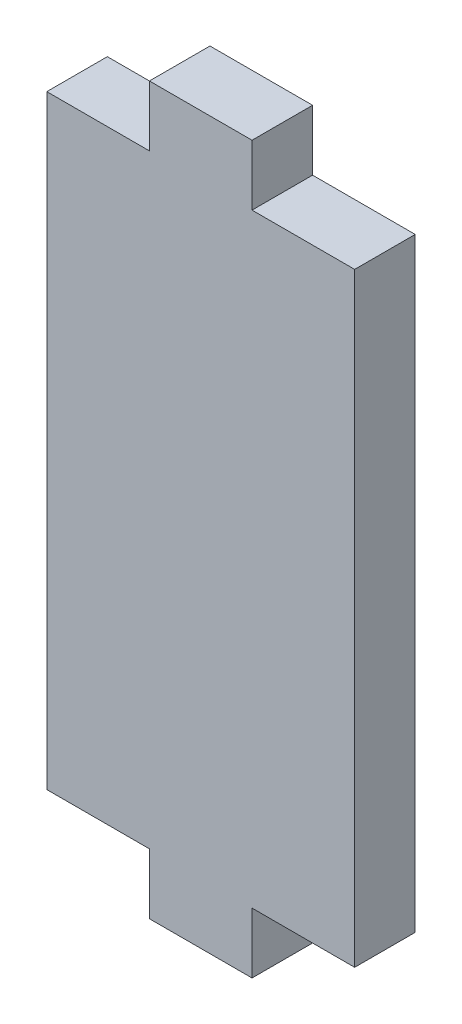
ISO-10303-21;
HEADER;
FILE_DESCRIPTION(('STEP AP214'),'2;1');
FILE_NAME('part.step','',(''),(''),'','','');
FILE_SCHEMA(('AUTOMOTIVE_DESIGN { 1 0 10303 214 1 1 1 1 }'));
ENDSEC;
DATA;
#1=APPLICATION_CONTEXT('core data for automotive mechanical design processes');
#2=APPLICATION_PROTOCOL_DEFINITION('international standard','automotive_design',2000,#1);
#3=PRODUCT_CONTEXT('',#1,'mechanical');
#4=PRODUCT('Part','Part','',(#3));
#5=PRODUCT_RELATED_PRODUCT_CATEGORY('part','',(#4));
#6=PRODUCT_DEFINITION_FORMATION('','',#4);
#7=PRODUCT_DEFINITION_CONTEXT('part definition',#1,'design');
#8=PRODUCT_DEFINITION('design','',#6,#7);
#9=PRODUCT_DEFINITION_SHAPE('','',#8);
#10=(LENGTH_UNIT() NAMED_UNIT(*) SI_UNIT(.MILLI.,.METRE.));
#11=(NAMED_UNIT(*) PLANE_ANGLE_UNIT() SI_UNIT($,.RADIAN.));
#12=(NAMED_UNIT(*) SI_UNIT($,.STERADIAN.) SOLID_ANGLE_UNIT());
#13=UNCERTAINTY_MEASURE_WITH_UNIT(LENGTH_MEASURE(1.E-05),#10,'distance_accuracy_value','');
#14=(GEOMETRIC_REPRESENTATION_CONTEXT(3) GLOBAL_UNCERTAINTY_ASSIGNED_CONTEXT((#13)) GLOBAL_UNIT_ASSIGNED_CONTEXT((#10,
#11,#12)) REPRESENTATION_CONTEXT('',''));
#15=CARTESIAN_POINT('',(0.,0.,0.));
#16=DIRECTION('',(0.,0.,1.));
#17=DIRECTION('',(1.,0.,0.));
#18=AXIS2_PLACEMENT_3D('',#15,#16,#17);
#19=CARTESIAN_POINT('',(0.,-29.45,5.9));
#20=DIRECTION('',(0.,1.,0.));
#21=DIRECTION('',(-1.,0.,0.));
#22=AXIS2_PLACEMENT_3D('',#19,#20,#21);
#23=PLANE('',#22);
#24=DIRECTION('',(1.,0.,0.));
#25=VECTOR('',#24,1.);
#26=CARTESIAN_POINT('',(0.,-29.45,0.));
#27=LINE('',#26,#25);
#28=CARTESIAN_POINT('',(-15.,-29.45,0.));
#29=VERTEX_POINT('',#28);
#30=CARTESIAN_POINT('',(-5.,-29.45,0.));
#31=VERTEX_POINT('',#30);
#32=EDGE_CURVE('E219',#29,#31,#27,.T.);
#33=ORIENTED_EDGE('',*,*,#32,.T.);
#34=DIRECTION('',(0.,0.,-1.));
#35=VECTOR('',#34,1.);
#36=CARTESIAN_POINT('',(-5.,-29.45,5.9));
#37=LINE('',#36,#35);
#38=CARTESIAN_POINT('',(-5.,-29.45,5.9));
#39=VERTEX_POINT('',#38);
#40=EDGE_CURVE('E11',#39,#31,#37,.T.);
#41=ORIENTED_EDGE('',*,*,#40,.F.);
#42=DIRECTION('',(1.,0.,0.));
#43=VECTOR('',#42,1.);
#44=CARTESIAN_POINT('',(0.,-29.45,5.9));
#45=LINE('',#44,#43);
#46=CARTESIAN_POINT('',(-15.,-29.45,5.9));
#47=VERTEX_POINT('',#46);
#48=EDGE_CURVE('E170',#47,#39,#45,.T.);
#49=ORIENTED_EDGE('',*,*,#48,.F.);
#50=DIRECTION('',(0.,0.,-1.));
#51=VECTOR('',#50,1.);
#52=CARTESIAN_POINT('',(-15.,-29.45,5.9));
#53=LINE('',#52,#51);
#54=EDGE_CURVE('E55',#47,#29,#53,.T.);
#55=ORIENTED_EDGE('',*,*,#54,.T.);
#56=EDGE_LOOP('',(#33,#41,#49,#55));
#57=FACE_BOUND('',#56,.T.);
#58=ADVANCED_FACE('F38',(#57),#23,.F.);
#59=CARTESIAN_POINT('',(-5.,0.,5.9));
#60=DIRECTION('',(1.,0.,0.));
#61=DIRECTION('',(0.,1.,0.));
#62=AXIS2_PLACEMENT_3D('',#59,#60,#61);
#63=PLANE('',#62);
#64=DIRECTION('',(0.,-1.,0.));
#65=VECTOR('',#64,1.);
#66=CARTESIAN_POINT('',(-5.,0.,0.));
#67=LINE('',#66,#65);
#68=CARTESIAN_POINT('',(-5.,-35.35,0.));
#69=VERTEX_POINT('',#68);
#70=EDGE_CURVE('E212',#31,#69,#67,.T.);
#71=ORIENTED_EDGE('',*,*,#70,.T.);
#72=DIRECTION('',(0.,0.,-1.));
#73=VECTOR('',#72,1.);
#74=CARTESIAN_POINT('',(-5.,-35.35,5.9));
#75=LINE('',#74,#73);
#76=CARTESIAN_POINT('',(-5.,-35.35,5.9));
#77=VERTEX_POINT('',#76);
#78=EDGE_CURVE('E47',#77,#69,#75,.T.);
#79=ORIENTED_EDGE('',*,*,#78,.F.);
#80=DIRECTION('',(0.,-1.,0.));
#81=VECTOR('',#80,1.);
#82=CARTESIAN_POINT('',(-5.,0.,5.9));
#83=LINE('',#82,#81);
#84=EDGE_CURVE('E105',#39,#77,#83,.T.);
#85=ORIENTED_EDGE('',*,*,#84,.F.);
#86=ORIENTED_EDGE('',*,*,#40,.T.);
#87=EDGE_LOOP('',(#71,#79,#85,#86));
#88=FACE_BOUND('',#87,.T.);
#89=ADVANCED_FACE('F40',(#88),#63,.F.);
#90=CARTESIAN_POINT('',(0.,-35.35,5.9));
#91=DIRECTION('',(0.,1.,0.));
#92=DIRECTION('',(0.,0.,1.));
#93=AXIS2_PLACEMENT_3D('',#90,#91,#92);
#94=PLANE('',#93);
#95=DIRECTION('',(1.,0.,0.));
#96=VECTOR('',#95,1.);
#97=CARTESIAN_POINT('',(0.,-35.35,0.));
#98=LINE('',#97,#96);
#99=CARTESIAN_POINT('',(5.,-35.35,0.));
#100=VERTEX_POINT('',#99);
#101=EDGE_CURVE('E209',#69,#100,#98,.T.);
#102=ORIENTED_EDGE('',*,*,#101,.T.);
#103=DIRECTION('',(0.,0.,-1.));
#104=VECTOR('',#103,1.);
#105=CARTESIAN_POINT('',(5.,-35.35,5.9));
#106=LINE('',#105,#104);
#107=CARTESIAN_POINT('',(5.,-35.35,5.9));
#108=VERTEX_POINT('',#107);
#109=EDGE_CURVE('E201',#108,#100,#106,.T.);
#110=ORIENTED_EDGE('',*,*,#109,.F.);
#111=DIRECTION('',(1.,0.,0.));
#112=VECTOR('',#111,1.);
#113=CARTESIAN_POINT('',(0.,-35.35,5.9));
#114=LINE('',#113,#112);
#115=EDGE_CURVE('E174',#77,#108,#114,.T.);
#116=ORIENTED_EDGE('',*,*,#115,.F.);
#117=ORIENTED_EDGE('',*,*,#78,.T.);
#118=EDGE_LOOP('',(#102,#110,#116,#117));
#119=FACE_BOUND('',#118,.T.);
#120=ADVANCED_FACE('F207',(#119),#94,.F.);
#121=CARTESIAN_POINT('',(5.,0.,5.9));
#122=DIRECTION('',(1.,0.,0.));
#123=DIRECTION('',(0.,1.,0.));
#124=AXIS2_PLACEMENT_3D('',#121,#122,#123);
#125=PLANE('',#124);
#126=DIRECTION('',(0.,-1.,0.));
#127=VECTOR('',#126,1.);
#128=CARTESIAN_POINT('',(5.,0.,0.));
#129=LINE('',#128,#127);
#130=CARTESIAN_POINT('',(5.,-29.45,0.));
#131=VERTEX_POINT('',#130);
#132=EDGE_CURVE('E215',#131,#100,#129,.T.);
#133=ORIENTED_EDGE('',*,*,#132,.F.);
#134=DIRECTION('',(0.,0.,-1.));
#135=VECTOR('',#134,1.);
#136=CARTESIAN_POINT('',(5.,-29.45,5.9));
#137=LINE('',#136,#135);
#138=CARTESIAN_POINT('',(5.,-29.45,5.9));
#139=VERTEX_POINT('',#138);
#140=EDGE_CURVE('E199',#139,#131,#137,.T.);
#141=ORIENTED_EDGE('',*,*,#140,.F.);
#142=DIRECTION('',(0.,-1.,0.));
#143=VECTOR('',#142,1.);
#144=CARTESIAN_POINT('',(5.,0.,5.9));
#145=LINE('',#144,#143);
#146=EDGE_CURVE('E168',#139,#108,#145,.T.);
#147=ORIENTED_EDGE('',*,*,#146,.T.);
#148=ORIENTED_EDGE('',*,*,#109,.T.);
#149=EDGE_LOOP('',(#133,#141,#147,#148));
#150=FACE_BOUND('',#149,.T.);
#151=ADVANCED_FACE('F267',(#150),#125,.T.);
#152=CARTESIAN_POINT('',(15.,-29.45,0.));
#153=VERTEX_POINT('',#152);
#154=EDGE_CURVE('E217',#131,#153,#27,.T.);
#155=ORIENTED_EDGE('',*,*,#154,.T.);
#156=DIRECTION('',(0.,0.,-1.));
#157=VECTOR('',#156,1.);
#158=CARTESIAN_POINT('',(15.,-29.45,5.9));
#159=LINE('',#158,#157);
#160=CARTESIAN_POINT('',(15.,-29.45,5.9));
#161=VERTEX_POINT('',#160);
#162=EDGE_CURVE('E196',#161,#153,#159,.T.);
#163=ORIENTED_EDGE('',*,*,#162,.F.);
#164=EDGE_CURVE('E165',#139,#161,#45,.T.);
#165=ORIENTED_EDGE('',*,*,#164,.F.);
#166=ORIENTED_EDGE('',*,*,#140,.T.);
#167=EDGE_LOOP('',(#155,#163,#165,#166));
#168=FACE_BOUND('',#167,.T.);
#169=ADVANCED_FACE('F247',(#168),#23,.F.);
#170=CARTESIAN_POINT('',(15.,0.,5.9));
#171=DIRECTION('',(-1.,0.,0.));
#172=DIRECTION('',(0.,-1.,0.));
#173=AXIS2_PLACEMENT_3D('',#170,#171,#172);
#174=PLANE('',#173);
#175=DIRECTION('',(0.,1.,0.));
#176=VECTOR('',#175,1.);
#177=CARTESIAN_POINT('',(15.,0.,0.));
#178=LINE('',#177,#176);
#179=CARTESIAN_POINT('',(15.,29.45,0.));
#180=VERTEX_POINT('',#179);
#181=EDGE_CURVE('E223',#153,#180,#178,.T.);
#182=ORIENTED_EDGE('',*,*,#181,.T.);
#183=DIRECTION('',(0.,0.,-1.));
#184=VECTOR('',#183,1.);
#185=CARTESIAN_POINT('',(15.,29.45,5.9));
#186=LINE('',#185,#184);
#187=CARTESIAN_POINT('',(15.,29.45,5.9));
#188=VERTEX_POINT('',#187);
#189=EDGE_CURVE('E194',#188,#180,#186,.T.);
#190=ORIENTED_EDGE('',*,*,#189,.F.);
#191=DIRECTION('',(0.,1.,0.));
#192=VECTOR('',#191,1.);
#193=CARTESIAN_POINT('',(15.,0.,5.9));
#194=LINE('',#193,#192);
#195=EDGE_CURVE('E162',#161,#188,#194,.T.);
#196=ORIENTED_EDGE('',*,*,#195,.F.);
#197=ORIENTED_EDGE('',*,*,#162,.T.);
#198=EDGE_LOOP('',(#182,#190,#196,#197));
#199=FACE_BOUND('',#198,.T.);
#200=ADVANCED_FACE('F243',(#199),#174,.F.);
#201=CARTESIAN_POINT('',(0.,29.45,5.9));
#202=DIRECTION('',(0.,1.,0.));
#203=DIRECTION('',(-1.,0.,0.));
#204=AXIS2_PLACEMENT_3D('',#201,#202,#203);
#205=PLANE('',#204);
#206=DIRECTION('',(1.,0.,0.));
#207=VECTOR('',#206,1.);
#208=CARTESIAN_POINT('',(0.,29.45,0.));
#209=LINE('',#208,#207);
#210=CARTESIAN_POINT('',(4.99999999999999,29.45,0.));
#211=VERTEX_POINT('',#210);
#212=EDGE_CURVE('E183',#211,#180,#209,.T.);
#213=ORIENTED_EDGE('',*,*,#212,.F.);
#214=DIRECTION('',(0.,0.,-1.));
#215=VECTOR('',#214,1.);
#216=CARTESIAN_POINT('',(4.99999999999999,29.45,5.9));
#217=LINE('',#216,#215);
#218=CARTESIAN_POINT('',(4.99999999999999,29.45,5.9));
#219=VERTEX_POINT('',#218);
#220=EDGE_CURVE('E192',#219,#211,#217,.T.);
#221=ORIENTED_EDGE('',*,*,#220,.F.);
#222=DIRECTION('',(1.,0.,0.));
#223=VECTOR('',#222,1.);
#224=CARTESIAN_POINT('',(0.,29.45,5.9));
#225=LINE('',#224,#223);
#226=EDGE_CURVE('E156',#219,#188,#225,.T.);
#227=ORIENTED_EDGE('',*,*,#226,.T.);
#228=ORIENTED_EDGE('',*,*,#189,.T.);
#229=EDGE_LOOP('',(#213,#221,#227,#228));
#230=FACE_BOUND('',#229,.T.);
#231=ADVANCED_FACE('F240',(#230),#205,.T.);
#232=CARTESIAN_POINT('',(4.99999999999999,0.,5.9));
#233=DIRECTION('',(-1.,0.,0.));
#234=DIRECTION('',(0.,0.,1.));
#235=AXIS2_PLACEMENT_3D('',#232,#233,#234);
#236=PLANE('',#235);
#237=DIRECTION('',(0.,1.,0.));
#238=VECTOR('',#237,1.);
#239=CARTESIAN_POINT('',(4.99999999999999,0.,0.));
#240=LINE('',#239,#238);
#241=CARTESIAN_POINT('',(4.99999999999999,35.35,0.));
#242=VERTEX_POINT('',#241);
#243=EDGE_CURVE('E227',#211,#242,#240,.T.);
#244=ORIENTED_EDGE('',*,*,#243,.T.);
#245=DIRECTION('',(0.,0.,-1.));
#246=VECTOR('',#245,1.);
#247=CARTESIAN_POINT('',(4.99999999999999,35.35,5.9));
#248=LINE('',#247,#246);
#249=CARTESIAN_POINT('',(4.99999999999999,35.35,5.9));
#250=VERTEX_POINT('',#249);
#251=EDGE_CURVE('E190',#250,#242,#248,.T.);
#252=ORIENTED_EDGE('',*,*,#251,.F.);
#253=DIRECTION('',(0.,1.,0.));
#254=VECTOR('',#253,1.);
#255=CARTESIAN_POINT('',(4.99999999999999,0.,5.9));
#256=LINE('',#255,#254);
#257=EDGE_CURVE('E161',#219,#250,#256,.T.);
#258=ORIENTED_EDGE('',*,*,#257,.F.);
#259=ORIENTED_EDGE('',*,*,#220,.T.);
#260=EDGE_LOOP('',(#244,#252,#258,#259));
#261=FACE_BOUND('',#260,.T.);
#262=ADVANCED_FACE('F239',(#261),#236,.F.);
#263=CARTESIAN_POINT('',(0.,35.35,5.9));
#264=DIRECTION('',(0.,1.,0.));
#265=DIRECTION('',(0.,0.,1.));
#266=AXIS2_PLACEMENT_3D('',#263,#264,#265);
#267=PLANE('',#266);
#268=DIRECTION('',(1.,0.,0.));
#269=VECTOR('',#268,1.);
#270=CARTESIAN_POINT('',(0.,35.35,0.));
#271=LINE('',#270,#269);
#272=CARTESIAN_POINT('',(-5.00000000000001,35.35,0.));
#273=VERTEX_POINT('',#272);
#274=EDGE_CURVE('E229',#273,#242,#271,.T.);
#275=ORIENTED_EDGE('',*,*,#274,.F.);
#276=DIRECTION('',(0.,0.,-1.));
#277=VECTOR('',#276,1.);
#278=CARTESIAN_POINT('',(-5.00000000000001,35.35,5.9));
#279=LINE('',#278,#277);
#280=CARTESIAN_POINT('',(-5.00000000000001,35.35,5.9));
#281=VERTEX_POINT('',#280);
#282=EDGE_CURVE('E142',#281,#273,#279,.T.);
#283=ORIENTED_EDGE('',*,*,#282,.F.);
#284=DIRECTION('',(1.,0.,0.));
#285=VECTOR('',#284,1.);
#286=CARTESIAN_POINT('',(0.,35.35,5.9));
#287=LINE('',#286,#285);
#288=EDGE_CURVE('E151',#281,#250,#287,.T.);
#289=ORIENTED_EDGE('',*,*,#288,.T.);
#290=ORIENTED_EDGE('',*,*,#251,.T.);
#291=EDGE_LOOP('',(#275,#283,#289,#290));
#292=FACE_BOUND('',#291,.T.);
#293=ADVANCED_FACE('F235',(#292),#267,.T.);
#294=CARTESIAN_POINT('',(-5.00000000000001,0.,5.9));
#295=DIRECTION('',(-1.,0.,0.));
#296=DIRECTION('',(0.,0.,1.));
#297=AXIS2_PLACEMENT_3D('',#294,#295,#296);
#298=PLANE('',#297);
#299=DIRECTION('',(0.,1.,0.));
#300=VECTOR('',#299,1.);
#301=CARTESIAN_POINT('',(-5.00000000000001,0.,0.));
#302=LINE('',#301,#300);
#303=CARTESIAN_POINT('',(-5.00000000000001,29.45,0.));
#304=VERTEX_POINT('',#303);
#305=EDGE_CURVE('E138',#304,#273,#302,.T.);
#306=ORIENTED_EDGE('',*,*,#305,.F.);
#307=DIRECTION('',(0.,0.,-1.));
#308=VECTOR('',#307,1.);
#309=CARTESIAN_POINT('',(-5.00000000000001,29.45,5.9));
#310=LINE('',#309,#308);
#311=CARTESIAN_POINT('',(-5.00000000000001,29.45,5.9));
#312=VERTEX_POINT('',#311);
#313=EDGE_CURVE('E133',#312,#304,#310,.T.);
#314=ORIENTED_EDGE('',*,*,#313,.F.);
#315=DIRECTION('',(0.,1.,0.));
#316=VECTOR('',#315,1.);
#317=CARTESIAN_POINT('',(-5.00000000000001,0.,5.9));
#318=LINE('',#317,#316);
#319=EDGE_CURVE('E136',#312,#281,#318,.T.);
#320=ORIENTED_EDGE('',*,*,#319,.T.);
#321=ORIENTED_EDGE('',*,*,#282,.T.);
#322=EDGE_LOOP('',(#306,#314,#320,#321));
#323=FACE_BOUND('',#322,.T.);
#324=ADVANCED_FACE('F135',(#323),#298,.T.);
#325=CARTESIAN_POINT('',(-15.,29.45,0.));
#326=VERTEX_POINT('',#325);
#327=EDGE_CURVE('E179',#326,#304,#209,.T.);
#328=ORIENTED_EDGE('',*,*,#327,.F.);
#329=DIRECTION('',(0.,0.,-1.));
#330=VECTOR('',#329,1.);
#331=CARTESIAN_POINT('',(-15.,29.45,5.9));
#332=LINE('',#331,#330);
#333=CARTESIAN_POINT('',(-15.,29.45,5.9));
#334=VERTEX_POINT('',#333);
#335=EDGE_CURVE('E93',#334,#326,#332,.T.);
#336=ORIENTED_EDGE('',*,*,#335,.F.);
#337=EDGE_CURVE('E149',#334,#312,#225,.T.);
#338=ORIENTED_EDGE('',*,*,#337,.T.);
#339=ORIENTED_EDGE('',*,*,#313,.T.);
#340=EDGE_LOOP('',(#328,#336,#338,#339));
#341=FACE_BOUND('',#340,.T.);
#342=ADVANCED_FACE('F153',(#341),#205,.T.);
#343=CARTESIAN_POINT('',(-15.,0.,5.9));
#344=DIRECTION('',(-1.,0.,0.));
#345=DIRECTION('',(0.,-1.,0.));
#346=AXIS2_PLACEMENT_3D('',#343,#344,#345);
#347=PLANE('',#346);
#348=DIRECTION('',(0.,1.,0.));
#349=VECTOR('',#348,1.);
#350=CARTESIAN_POINT('',(-15.,0.,0.));
#351=LINE('',#350,#349);
#352=EDGE_CURVE('E176',#29,#326,#351,.T.);
#353=ORIENTED_EDGE('',*,*,#352,.F.);
#354=ORIENTED_EDGE('',*,*,#54,.F.);
#355=DIRECTION('',(0.,1.,0.));
#356=VECTOR('',#355,1.);
#357=CARTESIAN_POINT('',(-15.,0.,5.9));
#358=LINE('',#357,#356);
#359=EDGE_CURVE('E154',#47,#334,#358,.T.);
#360=ORIENTED_EDGE('',*,*,#359,.T.);
#361=ORIENTED_EDGE('',*,*,#335,.T.);
#362=EDGE_LOOP('',(#353,#354,#360,#361));
#363=FACE_BOUND('',#362,.T.);
#364=ADVANCED_FACE('F249',(#363),#347,.T.);
#365=CARTESIAN_POINT('',(0.,0.,5.9));
#366=DIRECTION('',(0.,0.,1.));
#367=DIRECTION('',(1.,0.,0.));
#368=AXIS2_PLACEMENT_3D('',#365,#366,#367);
#369=PLANE('',#368);
#370=ORIENTED_EDGE('',*,*,#48,.T.);
#371=ORIENTED_EDGE('',*,*,#84,.T.);
#372=ORIENTED_EDGE('',*,*,#115,.T.);
#373=ORIENTED_EDGE('',*,*,#146,.F.);
#374=ORIENTED_EDGE('',*,*,#164,.T.);
#375=ORIENTED_EDGE('',*,*,#195,.T.);
#376=ORIENTED_EDGE('',*,*,#226,.F.);
#377=ORIENTED_EDGE('',*,*,#257,.T.);
#378=ORIENTED_EDGE('',*,*,#288,.F.);
#379=ORIENTED_EDGE('',*,*,#319,.F.);
#380=ORIENTED_EDGE('',*,*,#337,.F.);
#381=ORIENTED_EDGE('',*,*,#359,.F.);
#382=EDGE_LOOP('',(#370,#371,#372,#373,#374,#375,#376,#377,#378,#379,#380,#381));
#383=FACE_BOUND('',#382,.T.);
#384=ADVANCED_FACE('F147',(#383),#369,.T.);
#385=CARTESIAN_POINT('',(0.,0.,0.));
#386=DIRECTION('',(0.,0.,1.));
#387=DIRECTION('',(1.,0.,0.));
#388=AXIS2_PLACEMENT_3D('',#385,#386,#387);
#389=PLANE('',#388);
#390=ORIENTED_EDGE('',*,*,#32,.F.);
#391=ORIENTED_EDGE('',*,*,#352,.T.);
#392=ORIENTED_EDGE('',*,*,#327,.T.);
#393=ORIENTED_EDGE('',*,*,#305,.T.);
#394=ORIENTED_EDGE('',*,*,#274,.T.);
#395=ORIENTED_EDGE('',*,*,#243,.F.);
#396=ORIENTED_EDGE('',*,*,#212,.T.);
#397=ORIENTED_EDGE('',*,*,#181,.F.);
#398=ORIENTED_EDGE('',*,*,#154,.F.);
#399=ORIENTED_EDGE('',*,*,#132,.T.);
#400=ORIENTED_EDGE('',*,*,#101,.F.);
#401=ORIENTED_EDGE('',*,*,#70,.F.);
#402=EDGE_LOOP('',(#390,#391,#392,#393,#394,#395,#396,#397,#398,#399,#400,#401));
#403=FACE_BOUND('',#402,.T.);
#404=ADVANCED_FACE('F211',(#403),#389,.F.);
#405=CLOSED_SHELL('',(#58,#89,#120,#151,#169,#200,#231,#262,#293,#324,#342,#364,#384,#404));
#406=MANIFOLD_SOLID_BREP('B2',#405);
#407=ADVANCED_BREP_SHAPE_REPRESENTATION('',(#18,#406),#14);
#408=SHAPE_DEFINITION_REPRESENTATION(#9,#407);
ENDSEC;
END-ISO-10303-21;
